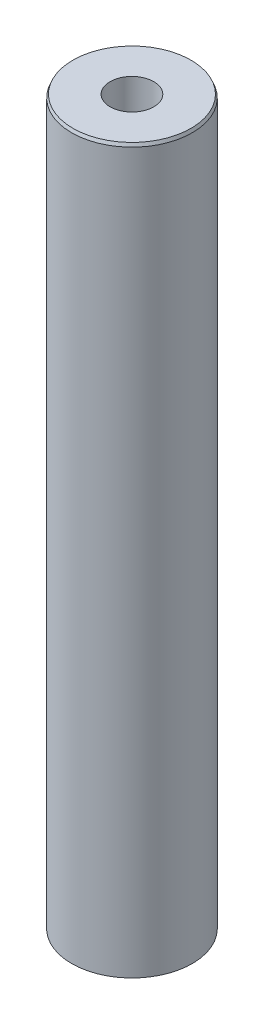
ISO-10303-21;
HEADER;
FILE_DESCRIPTION(('STEP AP214'),'2;1');
FILE_NAME('part.step','',(''),(''),'','','');
FILE_SCHEMA(('AUTOMOTIVE_DESIGN { 1 0 10303 214 1 1 1 1 }'));
ENDSEC;
DATA;
#1=APPLICATION_CONTEXT('core data for automotive mechanical design processes');
#2=APPLICATION_PROTOCOL_DEFINITION('international standard','automotive_design',2000,#1);
#3=PRODUCT_CONTEXT('',#1,'mechanical');
#4=PRODUCT('Part','Part','',(#3));
#5=PRODUCT_RELATED_PRODUCT_CATEGORY('part','',(#4));
#6=PRODUCT_DEFINITION_FORMATION('','',#4);
#7=PRODUCT_DEFINITION_CONTEXT('part definition',#1,'design');
#8=PRODUCT_DEFINITION('design','',#6,#7);
#9=PRODUCT_DEFINITION_SHAPE('','',#8);
#10=(LENGTH_UNIT() NAMED_UNIT(*) SI_UNIT(.MILLI.,.METRE.));
#11=(NAMED_UNIT(*) PLANE_ANGLE_UNIT() SI_UNIT($,.RADIAN.));
#12=(NAMED_UNIT(*) SI_UNIT($,.STERADIAN.) SOLID_ANGLE_UNIT());
#13=UNCERTAINTY_MEASURE_WITH_UNIT(LENGTH_MEASURE(1.E-05),#10,'distance_accuracy_value','');
#14=(GEOMETRIC_REPRESENTATION_CONTEXT(3) GLOBAL_UNCERTAINTY_ASSIGNED_CONTEXT((#13)) GLOBAL_UNIT_ASSIGNED_CONTEXT((#10,
#11,#12)) REPRESENTATION_CONTEXT('',''));
#15=CARTESIAN_POINT('',(0.,0.,0.));
#16=DIRECTION('',(0.,0.,1.));
#17=DIRECTION('',(1.,0.,0.));
#18=AXIS2_PLACEMENT_3D('',#15,#16,#17);
#19=CARTESIAN_POINT('',(0.,600.,0.));
#20=DIRECTION('',(0.,-1.,0.));
#21=DIRECTION('',(0.,0.,-1.));
#22=AXIS2_PLACEMENT_3D('',#19,#20,#21);
#23=CYLINDRICAL_SURFACE('',#22,50.);
#24=CARTESIAN_POINT('',(0.,597.345579968585,0.));
#25=DIRECTION('',(0.,1.,0.));
#26=DIRECTION('',(0.,0.,1.));
#27=AXIS2_PLACEMENT_3D('',#24,#25,#26);
#28=CIRCLE('',#27,50.);
#29=CARTESIAN_POINT('',(0.,597.345579968585,50.));
#30=VERTEX_POINT('',#29);
#31=EDGE_CURVE('E50',#30,#30,#28,.F.);
#32=ORIENTED_EDGE('',*,*,#31,.T.);
#33=EDGE_LOOP('',(#32));
#34=FACE_BOUND('',#33,.T.);
#35=CARTESIAN_POINT('',(0.,1.05246716485352,0.));
#36=DIRECTION('',(0.,1.,0.));
#37=DIRECTION('',(0.,0.,1.));
#38=AXIS2_PLACEMENT_3D('',#35,#36,#37);
#39=CIRCLE('',#38,50.);
#40=CARTESIAN_POINT('',(0.,1.05246716485352,50.));
#41=VERTEX_POINT('',#40);
#42=EDGE_CURVE('E51',#41,#41,#39,.T.);
#43=ORIENTED_EDGE('',*,*,#42,.T.);
#44=EDGE_LOOP('',(#43));
#45=FACE_BOUND('',#44,.T.);
#46=ADVANCED_FACE('F39',(#34,#45),#23,.T.);
#47=CARTESIAN_POINT('',(0.,600.,0.));
#48=DIRECTION('',(0.,1.,0.));
#49=DIRECTION('',(0.,0.,1.));
#50=AXIS2_PLACEMENT_3D('',#47,#48,#49);
#51=PLANE('',#50);
#52=CARTESIAN_POINT('',(0.,600.,0.));
#53=DIRECTION('',(0.,1.,0.));
#54=DIRECTION('',(0.,0.,1.));
#55=AXIS2_PLACEMENT_3D('',#52,#53,#54);
#56=CIRCLE('',#55,48.9475328351466);
#57=CARTESIAN_POINT('',(0.,600.,48.9475328351466));
#58=VERTEX_POINT('',#57);
#59=EDGE_CURVE('E54',#58,#58,#56,.T.);
#60=ORIENTED_EDGE('',*,*,#59,.T.);
#61=EDGE_LOOP('',(#60));
#62=FACE_BOUND('',#61,.T.);
#63=CARTESIAN_POINT('',(0.,600.,0.));
#64=DIRECTION('',(0.,1.,0.));
#65=DIRECTION('',(0.,0.,1.));
#66=AXIS2_PLACEMENT_3D('',#63,#64,#65);
#67=CIRCLE('',#66,18.0934833642801);
#68=CARTESIAN_POINT('',(0.,600.,18.0934833642801));
#69=VERTEX_POINT('',#68);
#70=EDGE_CURVE('E58',#69,#69,#67,.T.);
#71=ORIENTED_EDGE('',*,*,#70,.F.);
#72=EDGE_LOOP('',(#71));
#73=FACE_BOUND('',#72,.T.);
#74=ADVANCED_FACE('F69',(#62,#73),#51,.T.);
#75=CARTESIAN_POINT('',(0.,0.,0.));
#76=DIRECTION('',(0.,1.,0.));
#77=DIRECTION('',(0.,0.,1.));
#78=AXIS2_PLACEMENT_3D('',#75,#76,#77);
#79=PLANE('',#78);
#80=CARTESIAN_POINT('',(0.,0.,0.));
#81=DIRECTION('',(0.,1.,0.));
#82=DIRECTION('',(0.,0.,1.));
#83=AXIS2_PLACEMENT_3D('',#80,#81,#82);
#84=CIRCLE('',#83,47.3455799685847);
#85=CARTESIAN_POINT('',(0.,0.,47.3455799685847));
#86=VERTEX_POINT('',#85);
#87=EDGE_CURVE('E10',#86,#86,#84,.F.);
#88=ORIENTED_EDGE('',*,*,#87,.T.);
#89=EDGE_LOOP('',(#88));
#90=FACE_BOUND('',#89,.T.);
#91=CARTESIAN_POINT('',(0.,0.,0.));
#92=DIRECTION('',(0.,1.,0.));
#93=DIRECTION('',(0.,0.,1.));
#94=AXIS2_PLACEMENT_3D('',#91,#92,#93);
#95=CIRCLE('',#94,18.0934833642801);
#96=CARTESIAN_POINT('',(0.,0.,18.0934833642801));
#97=VERTEX_POINT('',#96);
#98=EDGE_CURVE('E63',#97,#97,#95,.T.);
#99=ORIENTED_EDGE('',*,*,#98,.T.);
#100=EDGE_LOOP('',(#99));
#101=FACE_BOUND('',#100,.T.);
#102=ADVANCED_FACE('F75',(#90,#101),#79,.F.);
#103=CARTESIAN_POINT('',(0.,600.,0.));
#104=DIRECTION('',(0.,-1.,0.));
#105=DIRECTION('',(0.,0.,-1.));
#106=AXIS2_PLACEMENT_3D('',#103,#104,#105);
#107=CYLINDRICAL_SURFACE('',#106,18.0934833642801);
#108=ORIENTED_EDGE('',*,*,#70,.T.);
#109=EDGE_LOOP('',(#108));
#110=FACE_BOUND('',#109,.T.);
#111=ORIENTED_EDGE('',*,*,#98,.F.);
#112=EDGE_LOOP('',(#111));
#113=FACE_BOUND('',#112,.T.);
#114=ADVANCED_FACE('F70',(#110,#113),#107,.F.);
#115=CARTESIAN_POINT('',(0.,600.,0.));
#116=DIRECTION('',(0.,-1.,0.));
#117=DIRECTION('',(0.,0.,-1.));
#118=AXIS2_PLACEMENT_3D('',#115,#116,#117);
#119=CONICAL_SURFACE('',#118,48.9475328351466,0.377482120593656);
#120=ORIENTED_EDGE('',*,*,#31,.F.);
#121=EDGE_LOOP('',(#120));
#122=FACE_BOUND('',#121,.T.);
#123=ORIENTED_EDGE('',*,*,#59,.F.);
#124=EDGE_LOOP('',(#123));
#125=FACE_BOUND('',#124,.T.);
#126=ADVANCED_FACE('F81',(#122,#125),#119,.T.);
#127=CARTESIAN_POINT('',(0.,1.05246716485352,0.));
#128=DIRECTION('',(0.,1.,0.));
#129=DIRECTION('',(0.,0.,1.));
#130=AXIS2_PLACEMENT_3D('',#127,#128,#129);
#131=CONICAL_SURFACE('',#130,50.,1.19331420620124);
#132=ORIENTED_EDGE('',*,*,#87,.F.);
#133=EDGE_LOOP('',(#132));
#134=FACE_BOUND('',#133,.T.);
#135=ORIENTED_EDGE('',*,*,#42,.F.);
#136=EDGE_LOOP('',(#135));
#137=FACE_BOUND('',#136,.T.);
#138=ADVANCED_FACE('F45',(#134,#137),#131,.T.);
#139=CLOSED_SHELL('',(#46,#74,#102,#114,#126,#138));
#140=MANIFOLD_SOLID_BREP('B2',#139);
#141=ADVANCED_BREP_SHAPE_REPRESENTATION('',(#18,#140),#14);
#142=SHAPE_DEFINITION_REPRESENTATION(#9,#141);
ENDSEC;
END-ISO-10303-21;
